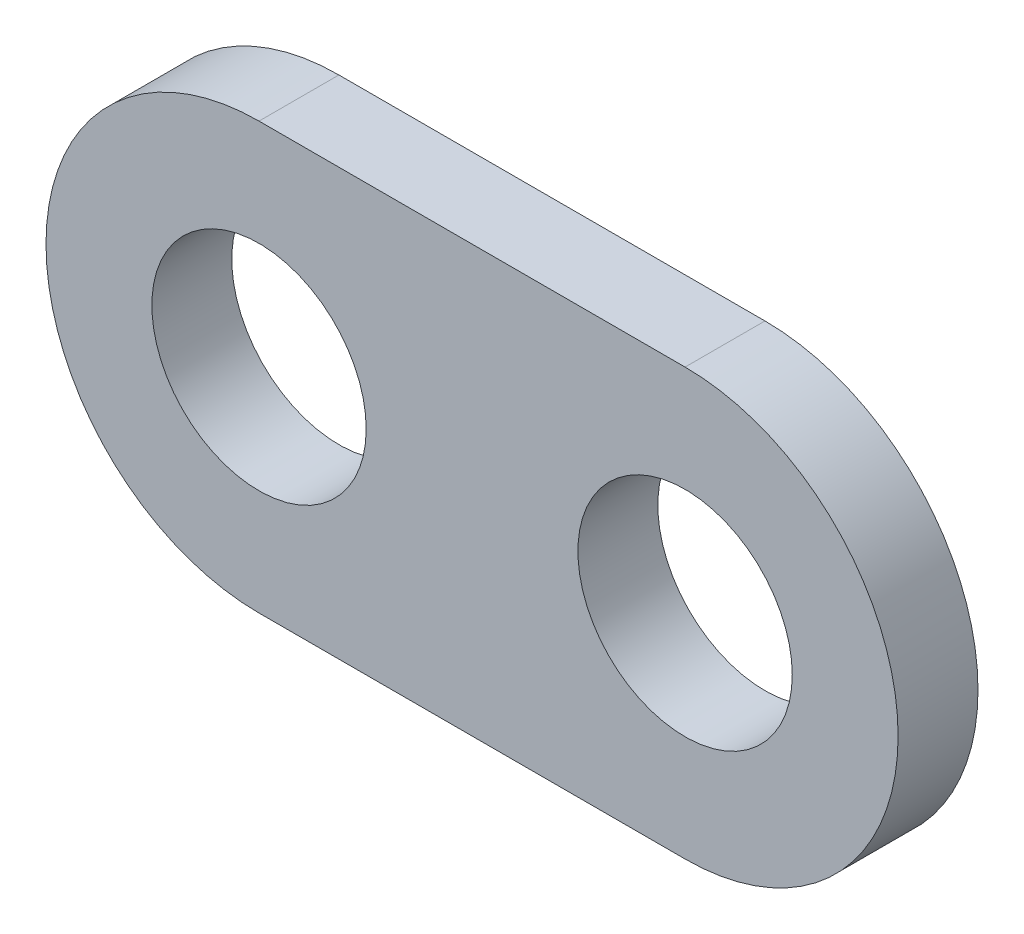
ISO-10303-21;
HEADER;
FILE_DESCRIPTION(('STEP AP214'),'2;1');
FILE_NAME('part.step','',(''),(''),'','','');
FILE_SCHEMA(('AUTOMOTIVE_DESIGN { 1 0 10303 214 1 1 1 1 }'));
ENDSEC;
DATA;
#1=APPLICATION_CONTEXT('core data for automotive mechanical design processes');
#2=APPLICATION_PROTOCOL_DEFINITION('international standard','automotive_design',2000,#1);
#3=PRODUCT_CONTEXT('',#1,'mechanical');
#4=PRODUCT('Part','Part','',(#3));
#5=PRODUCT_RELATED_PRODUCT_CATEGORY('part','',(#4));
#6=PRODUCT_DEFINITION_FORMATION('','',#4);
#7=PRODUCT_DEFINITION_CONTEXT('part definition',#1,'design');
#8=PRODUCT_DEFINITION('design','',#6,#7);
#9=PRODUCT_DEFINITION_SHAPE('','',#8);
#10=(LENGTH_UNIT() NAMED_UNIT(*) SI_UNIT(.MILLI.,.METRE.));
#11=(NAMED_UNIT(*) PLANE_ANGLE_UNIT() SI_UNIT($,.RADIAN.));
#12=(NAMED_UNIT(*) SI_UNIT($,.STERADIAN.) SOLID_ANGLE_UNIT());
#13=UNCERTAINTY_MEASURE_WITH_UNIT(LENGTH_MEASURE(1.E-05),#10,'distance_accuracy_value','');
#14=(GEOMETRIC_REPRESENTATION_CONTEXT(3) GLOBAL_UNCERTAINTY_ASSIGNED_CONTEXT((#13)) GLOBAL_UNIT_ASSIGNED_CONTEXT((#10,
#11,#12)) REPRESENTATION_CONTEXT('',''));
#15=CARTESIAN_POINT('',(0.,0.,0.));
#16=DIRECTION('',(0.,0.,1.));
#17=DIRECTION('',(1.,0.,0.));
#18=AXIS2_PLACEMENT_3D('',#15,#16,#17);
#19=CARTESIAN_POINT('',(0.,38.,9.));
#20=DIRECTION('',(0.,1.,0.));
#21=DIRECTION('',(0.,0.,1.));
#22=AXIS2_PLACEMENT_3D('',#19,#20,#21);
#23=PLANE('',#22);
#24=DIRECTION('',(1.,0.,0.));
#25=VECTOR('',#24,1.);
#26=CARTESIAN_POINT('',(0.,38.,6.));
#27=LINE('',#26,#25);
#28=CARTESIAN_POINT('',(7.99999999999999,38.,6.));
#29=VERTEX_POINT('',#28);
#30=CARTESIAN_POINT('',(24.,38.,6.));
#31=VERTEX_POINT('',#30);
#32=EDGE_CURVE('E128',#29,#31,#27,.T.);
#33=ORIENTED_EDGE('',*,*,#32,.T.);
#34=DIRECTION('',(0.,0.,-1.));
#35=VECTOR('',#34,1.);
#36=CARTESIAN_POINT('',(24.,38.,9.));
#37=LINE('',#36,#35);
#38=CARTESIAN_POINT('',(24.,38.,9.));
#39=VERTEX_POINT('',#38);
#40=EDGE_CURVE('E11',#39,#31,#37,.T.);
#41=ORIENTED_EDGE('',*,*,#40,.F.);
#42=DIRECTION('',(1.,0.,0.));
#43=VECTOR('',#42,1.);
#44=CARTESIAN_POINT('',(0.,38.,9.));
#45=LINE('',#44,#43);
#46=CARTESIAN_POINT('',(7.99999999999999,38.,9.));
#47=VERTEX_POINT('',#46);
#48=EDGE_CURVE('E98',#47,#39,#45,.T.);
#49=ORIENTED_EDGE('',*,*,#48,.F.);
#50=DIRECTION('',(0.,0.,-1.));
#51=VECTOR('',#50,1.);
#52=CARTESIAN_POINT('',(7.99999999999999,38.,9.));
#53=LINE('',#52,#51);
#54=EDGE_CURVE('E116',#47,#29,#53,.T.);
#55=ORIENTED_EDGE('',*,*,#54,.T.);
#56=EDGE_LOOP('',(#33,#41,#49,#55));
#57=FACE_BOUND('',#56,.T.);
#58=ADVANCED_FACE('F49',(#57),#23,.F.);
#59=CARTESIAN_POINT('',(24.,46.,9.));
#60=DIRECTION('',(0.,0.,-1.));
#61=DIRECTION('',(-1.,0.,0.));
#62=AXIS2_PLACEMENT_3D('',#59,#60,#61);
#63=CYLINDRICAL_SURFACE('',#62,8.);
#64=CARTESIAN_POINT('',(24.,46.,6.));
#65=DIRECTION('',(0.,0.,1.));
#66=DIRECTION('',(1.,0.,0.));
#67=AXIS2_PLACEMENT_3D('',#64,#65,#66);
#68=CIRCLE('',#67,8.);
#69=CARTESIAN_POINT('',(24.,54.,6.));
#70=VERTEX_POINT('',#69);
#71=EDGE_CURVE('E104',#31,#70,#68,.T.);
#72=ORIENTED_EDGE('',*,*,#71,.T.);
#73=DIRECTION('',(0.,0.,-1.));
#74=VECTOR('',#73,1.);
#75=CARTESIAN_POINT('',(24.,54.,9.));
#76=LINE('',#75,#74);
#77=CARTESIAN_POINT('',(24.,54.,9.));
#78=VERTEX_POINT('',#77);
#79=EDGE_CURVE('E59',#78,#70,#76,.T.);
#80=ORIENTED_EDGE('',*,*,#79,.F.);
#81=CARTESIAN_POINT('',(24.,46.,9.));
#82=DIRECTION('',(0.,0.,1.));
#83=DIRECTION('',(1.,0.,0.));
#84=AXIS2_PLACEMENT_3D('',#81,#82,#83);
#85=CIRCLE('',#84,8.);
#86=EDGE_CURVE('E93',#39,#78,#85,.T.);
#87=ORIENTED_EDGE('',*,*,#86,.F.);
#88=ORIENTED_EDGE('',*,*,#40,.T.);
#89=EDGE_LOOP('',(#72,#80,#87,#88));
#90=FACE_BOUND('',#89,.T.);
#91=ADVANCED_FACE('F103',(#90),#63,.T.);
#92=CARTESIAN_POINT('',(0.,54.,9.));
#93=DIRECTION('',(0.,1.,0.));
#94=DIRECTION('',(0.,0.,1.));
#95=AXIS2_PLACEMENT_3D('',#92,#93,#94);
#96=PLANE('',#95);
#97=DIRECTION('',(1.,0.,0.));
#98=VECTOR('',#97,1.);
#99=CARTESIAN_POINT('',(0.,54.,6.));
#100=LINE('',#99,#98);
#101=CARTESIAN_POINT('',(8.,54.,6.));
#102=VERTEX_POINT('',#101);
#103=EDGE_CURVE('E133',#102,#70,#100,.T.);
#104=ORIENTED_EDGE('',*,*,#103,.F.);
#105=DIRECTION('',(0.,0.,-1.));
#106=VECTOR('',#105,1.);
#107=CARTESIAN_POINT('',(8.,54.,9.));
#108=LINE('',#107,#106);
#109=CARTESIAN_POINT('',(8.,54.,9.));
#110=VERTEX_POINT('',#109);
#111=EDGE_CURVE('E83',#110,#102,#108,.T.);
#112=ORIENTED_EDGE('',*,*,#111,.F.);
#113=DIRECTION('',(1.,0.,0.));
#114=VECTOR('',#113,1.);
#115=CARTESIAN_POINT('',(0.,54.,9.));
#116=LINE('',#115,#114);
#117=EDGE_CURVE('E96',#110,#78,#116,.T.);
#118=ORIENTED_EDGE('',*,*,#117,.T.);
#119=ORIENTED_EDGE('',*,*,#79,.T.);
#120=EDGE_LOOP('',(#104,#112,#118,#119));
#121=FACE_BOUND('',#120,.T.);
#122=ADVANCED_FACE('F109',(#121),#96,.T.);
#123=CARTESIAN_POINT('',(8.,46.,9.));
#124=DIRECTION('',(0.,0.,-1.));
#125=DIRECTION('',(-1.,0.,0.));
#126=AXIS2_PLACEMENT_3D('',#123,#124,#125);
#127=CYLINDRICAL_SURFACE('',#126,4.025);
#128=CARTESIAN_POINT('',(8.,46.,9.));
#129=DIRECTION('',(0.,0.,1.));
#130=DIRECTION('',(1.,0.,0.));
#131=AXIS2_PLACEMENT_3D('',#128,#129,#130);
#132=CIRCLE('',#131,4.025);
#133=CARTESIAN_POINT('',(12.025,46.,9.));
#134=VERTEX_POINT('',#133);
#135=EDGE_CURVE('E156',#134,#134,#132,.T.);
#136=ORIENTED_EDGE('',*,*,#135,.T.);
#137=EDGE_LOOP('',(#136));
#138=FACE_BOUND('',#137,.T.);
#139=CARTESIAN_POINT('',(8.,46.,6.));
#140=DIRECTION('',(0.,0.,1.));
#141=DIRECTION('',(1.,0.,0.));
#142=AXIS2_PLACEMENT_3D('',#139,#140,#141);
#143=CIRCLE('',#142,4.025);
#144=CARTESIAN_POINT('',(12.025,46.,6.));
#145=VERTEX_POINT('',#144);
#146=EDGE_CURVE('E124',#145,#145,#143,.T.);
#147=ORIENTED_EDGE('',*,*,#146,.F.);
#148=EDGE_LOOP('',(#147));
#149=FACE_BOUND('',#148,.T.);
#150=ADVANCED_FACE('F175',(#138,#149),#127,.F.);
#151=CARTESIAN_POINT('',(24.,46.,9.));
#152=DIRECTION('',(0.,0.,-1.));
#153=DIRECTION('',(-1.,0.,0.));
#154=AXIS2_PLACEMENT_3D('',#151,#152,#153);
#155=CYLINDRICAL_SURFACE('',#154,4.025);
#156=CARTESIAN_POINT('',(24.,46.,9.));
#157=DIRECTION('',(0.,0.,1.));
#158=DIRECTION('',(1.,0.,0.));
#159=AXIS2_PLACEMENT_3D('',#156,#157,#158);
#160=CIRCLE('',#159,4.025);
#161=CARTESIAN_POINT('',(28.025,46.,9.));
#162=VERTEX_POINT('',#161);
#163=EDGE_CURVE('E138',#162,#162,#160,.T.);
#164=ORIENTED_EDGE('',*,*,#163,.T.);
#165=EDGE_LOOP('',(#164));
#166=FACE_BOUND('',#165,.T.);
#167=CARTESIAN_POINT('',(24.,46.,6.));
#168=DIRECTION('',(0.,0.,1.));
#169=DIRECTION('',(1.,0.,0.));
#170=AXIS2_PLACEMENT_3D('',#167,#168,#169);
#171=CIRCLE('',#170,4.025);
#172=CARTESIAN_POINT('',(28.025,46.,6.));
#173=VERTEX_POINT('',#172);
#174=EDGE_CURVE('E120',#173,#173,#171,.T.);
#175=ORIENTED_EDGE('',*,*,#174,.F.);
#176=EDGE_LOOP('',(#175));
#177=FACE_BOUND('',#176,.T.);
#178=ADVANCED_FACE('F51',(#166,#177),#155,.F.);
#179=CARTESIAN_POINT('',(8.,46.,9.));
#180=DIRECTION('',(0.,0.,-1.));
#181=DIRECTION('',(-1.,0.,0.));
#182=AXIS2_PLACEMENT_3D('',#179,#180,#181);
#183=CYLINDRICAL_SURFACE('',#182,8.);
#184=CARTESIAN_POINT('',(8.,46.,6.));
#185=DIRECTION('',(0.,0.,1.));
#186=DIRECTION('',(1.,0.,0.));
#187=AXIS2_PLACEMENT_3D('',#184,#185,#186);
#188=CIRCLE('',#187,8.);
#189=EDGE_CURVE('E86',#102,#29,#188,.T.);
#190=ORIENTED_EDGE('',*,*,#189,.T.);
#191=ORIENTED_EDGE('',*,*,#54,.F.);
#192=CARTESIAN_POINT('',(8.,46.,9.));
#193=DIRECTION('',(0.,0.,1.));
#194=DIRECTION('',(1.,0.,0.));
#195=AXIS2_PLACEMENT_3D('',#192,#193,#194);
#196=CIRCLE('',#195,8.);
#197=EDGE_CURVE('E67',#110,#47,#196,.T.);
#198=ORIENTED_EDGE('',*,*,#197,.F.);
#199=ORIENTED_EDGE('',*,*,#111,.T.);
#200=EDGE_LOOP('',(#190,#191,#198,#199));
#201=FACE_BOUND('',#200,.T.);
#202=ADVANCED_FACE('F171',(#201),#183,.T.);
#203=CARTESIAN_POINT('',(0.,0.,9.));
#204=DIRECTION('',(0.,0.,1.));
#205=DIRECTION('',(1.,0.,0.));
#206=AXIS2_PLACEMENT_3D('',#203,#204,#205);
#207=PLANE('',#206);
#208=ORIENTED_EDGE('',*,*,#163,.F.);
#209=EDGE_LOOP('',(#208));
#210=FACE_BOUND('',#209,.T.);
#211=ORIENTED_EDGE('',*,*,#135,.F.);
#212=EDGE_LOOP('',(#211));
#213=FACE_BOUND('',#212,.T.);
#214=ORIENTED_EDGE('',*,*,#48,.T.);
#215=ORIENTED_EDGE('',*,*,#86,.T.);
#216=ORIENTED_EDGE('',*,*,#117,.F.);
#217=ORIENTED_EDGE('',*,*,#197,.T.);
#218=EDGE_LOOP('',(#214,#215,#216,#217));
#219=FACE_BOUND('',#218,.T.);
#220=ADVANCED_FACE('F94',(#210,#213,#219),#207,.T.);
#221=CARTESIAN_POINT('',(0.,0.,6.));
#222=DIRECTION('',(0.,0.,1.));
#223=DIRECTION('',(1.,0.,0.));
#224=AXIS2_PLACEMENT_3D('',#221,#222,#223);
#225=PLANE('',#224);
#226=ORIENTED_EDGE('',*,*,#174,.T.);
#227=EDGE_LOOP('',(#226));
#228=FACE_BOUND('',#227,.T.);
#229=ORIENTED_EDGE('',*,*,#146,.T.);
#230=EDGE_LOOP('',(#229));
#231=FACE_BOUND('',#230,.T.);
#232=ORIENTED_EDGE('',*,*,#32,.F.);
#233=ORIENTED_EDGE('',*,*,#189,.F.);
#234=ORIENTED_EDGE('',*,*,#103,.T.);
#235=ORIENTED_EDGE('',*,*,#71,.F.);
#236=EDGE_LOOP('',(#232,#233,#234,#235));
#237=FACE_BOUND('',#236,.T.);
#238=ADVANCED_FACE('F170',(#228,#231,#237),#225,.F.);
#239=CLOSED_SHELL('',(#58,#91,#122,#150,#178,#202,#220,#238));
#240=MANIFOLD_SOLID_BREP('B2',#239);
#241=ADVANCED_BREP_SHAPE_REPRESENTATION('',(#18,#240),#14);
#242=SHAPE_DEFINITION_REPRESENTATION(#9,#241);
ENDSEC;
END-ISO-10303-21;
